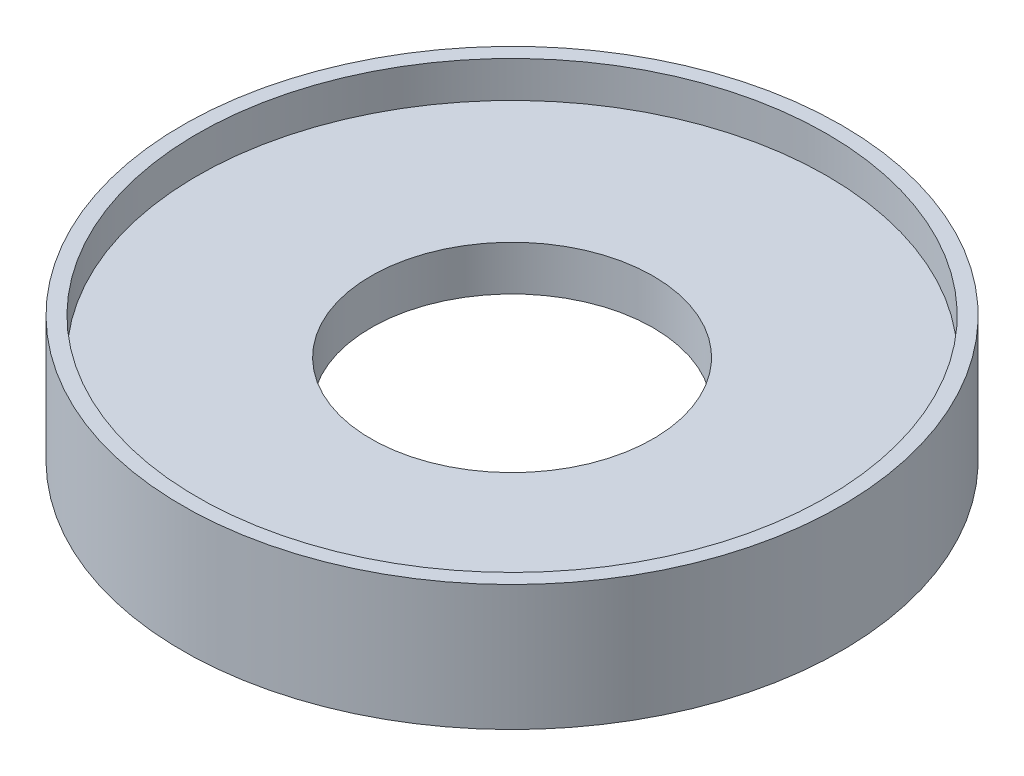
ISO-10303-21;
HEADER;
FILE_DESCRIPTION(('STEP AP214'),'2;1');
FILE_NAME('part.step','',(''),(''),'','','');
FILE_SCHEMA(('AUTOMOTIVE_DESIGN { 1 0 10303 214 1 1 1 1 }'));
ENDSEC;
DATA;
#1=APPLICATION_CONTEXT('core data for automotive mechanical design processes');
#2=APPLICATION_PROTOCOL_DEFINITION('international standard','automotive_design',2000,#1);
#3=PRODUCT_CONTEXT('',#1,'mechanical');
#4=PRODUCT('Part','Part','',(#3));
#5=PRODUCT_RELATED_PRODUCT_CATEGORY('part','',(#4));
#6=PRODUCT_DEFINITION_FORMATION('','',#4);
#7=PRODUCT_DEFINITION_CONTEXT('part definition',#1,'design');
#8=PRODUCT_DEFINITION('design','',#6,#7);
#9=PRODUCT_DEFINITION_SHAPE('','',#8);
#10=(LENGTH_UNIT() NAMED_UNIT(*) SI_UNIT(.MILLI.,.METRE.));
#11=(NAMED_UNIT(*) PLANE_ANGLE_UNIT() SI_UNIT($,.RADIAN.));
#12=(NAMED_UNIT(*) SI_UNIT($,.STERADIAN.) SOLID_ANGLE_UNIT());
#13=UNCERTAINTY_MEASURE_WITH_UNIT(LENGTH_MEASURE(1.E-05),#10,'distance_accuracy_value','');
#14=(GEOMETRIC_REPRESENTATION_CONTEXT(3) GLOBAL_UNCERTAINTY_ASSIGNED_CONTEXT((#13)) GLOBAL_UNIT_ASSIGNED_CONTEXT((#10,
#11,#12)) REPRESENTATION_CONTEXT('',''));
#15=CARTESIAN_POINT('',(0.,0.,0.));
#16=DIRECTION('',(0.,0.,1.));
#17=DIRECTION('',(1.,0.,0.));
#18=AXIS2_PLACEMENT_3D('',#15,#16,#17);
#19=CARTESIAN_POINT('',(0.,0.,0.));
#20=DIRECTION('',(0.,-1.,0.));
#21=DIRECTION('',(0.,0.,-1.));
#22=AXIS2_PLACEMENT_3D('',#19,#20,#21);
#23=CYLINDRICAL_SURFACE('',#22,19.05);
#24=CARTESIAN_POINT('',(0.,0.,0.));
#25=DIRECTION('',(0.,-1.,0.));
#26=DIRECTION('',(0.,0.,-1.));
#27=AXIS2_PLACEMENT_3D('',#24,#25,#26);
#28=CIRCLE('',#27,19.05);
#29=CARTESIAN_POINT('',(0.,0.,-19.05));
#30=VERTEX_POINT('',#29);
#31=EDGE_CURVE('E10',#30,#30,#28,.T.);
#32=ORIENTED_EDGE('',*,*,#31,.T.);
#33=EDGE_LOOP('',(#32));
#34=FACE_BOUND('',#33,.T.);
#35=CARTESIAN_POINT('',(0.,6.05,0.));
#36=DIRECTION('',(0.,-1.,0.));
#37=DIRECTION('',(0.,0.,-1.));
#38=AXIS2_PLACEMENT_3D('',#35,#36,#37);
#39=CIRCLE('',#38,19.05);
#40=CARTESIAN_POINT('',(0.,6.05,-19.05));
#41=VERTEX_POINT('',#40);
#42=EDGE_CURVE('E56',#41,#41,#39,.T.);
#43=ORIENTED_EDGE('',*,*,#42,.F.);
#44=EDGE_LOOP('',(#43));
#45=FACE_BOUND('',#44,.T.);
#46=ADVANCED_FACE('F28',(#34,#45),#23,.F.);
#47=CARTESIAN_POINT('',(0.,0.,-19.05));
#48=DIRECTION('',(0.,-1.,0.));
#49=DIRECTION('',(0.,0.,-1.));
#50=AXIS2_PLACEMENT_3D('',#47,#48,#49);
#51=PLANE('',#50);
#52=CARTESIAN_POINT('',(0.,0.,0.));
#53=DIRECTION('',(0.,-1.,0.));
#54=DIRECTION('',(0.,0.,-1.));
#55=AXIS2_PLACEMENT_3D('',#52,#53,#54);
#56=CIRCLE('',#55,42.5);
#57=CARTESIAN_POINT('',(0.,0.,-42.5));
#58=VERTEX_POINT('',#57);
#59=EDGE_CURVE('E34',#58,#58,#56,.T.);
#60=ORIENTED_EDGE('',*,*,#59,.T.);
#61=EDGE_LOOP('',(#60));
#62=FACE_BOUND('',#61,.T.);
#63=ORIENTED_EDGE('',*,*,#31,.F.);
#64=EDGE_LOOP('',(#63));
#65=FACE_BOUND('',#64,.T.);
#66=ADVANCED_FACE('F64',(#62,#65),#51,.T.);
#67=CARTESIAN_POINT('',(0.,0.,0.));
#68=DIRECTION('',(0.,-1.,0.));
#69=DIRECTION('',(0.,0.,-1.));
#70=AXIS2_PLACEMENT_3D('',#67,#68,#69);
#71=CYLINDRICAL_SURFACE('',#70,42.5);
#72=CARTESIAN_POINT('',(0.,-6.,0.));
#73=DIRECTION('',(0.,-1.,0.));
#74=DIRECTION('',(0.,0.,-1.));
#75=AXIS2_PLACEMENT_3D('',#72,#73,#74);
#76=CIRCLE('',#75,42.5);
#77=CARTESIAN_POINT('',(0.,-6.,-42.5));
#78=VERTEX_POINT('',#77);
#79=EDGE_CURVE('E38',#78,#78,#76,.T.);
#80=ORIENTED_EDGE('',*,*,#79,.T.);
#81=EDGE_LOOP('',(#80));
#82=FACE_BOUND('',#81,.T.);
#83=ORIENTED_EDGE('',*,*,#59,.F.);
#84=EDGE_LOOP('',(#83));
#85=FACE_BOUND('',#84,.T.);
#86=ADVANCED_FACE('F68',(#82,#85),#71,.F.);
#87=CARTESIAN_POINT('',(0.,-6.,-42.5));
#88=DIRECTION('',(0.,-1.,0.));
#89=DIRECTION('',(0.,0.,-1.));
#90=AXIS2_PLACEMENT_3D('',#87,#88,#89);
#91=PLANE('',#90);
#92=CARTESIAN_POINT('',(0.,-6.,0.));
#93=DIRECTION('',(0.,-1.,0.));
#94=DIRECTION('',(0.,0.,-1.));
#95=AXIS2_PLACEMENT_3D('',#92,#93,#94);
#96=CIRCLE('',#95,44.5);
#97=CARTESIAN_POINT('',(0.,-6.,-44.5));
#98=VERTEX_POINT('',#97);
#99=EDGE_CURVE('E42',#98,#98,#96,.T.);
#100=ORIENTED_EDGE('',*,*,#99,.T.);
#101=EDGE_LOOP('',(#100));
#102=FACE_BOUND('',#101,.T.);
#103=ORIENTED_EDGE('',*,*,#79,.F.);
#104=EDGE_LOOP('',(#103));
#105=FACE_BOUND('',#104,.T.);
#106=ADVANCED_FACE('F72',(#102,#105),#91,.T.);
#107=CARTESIAN_POINT('',(0.,0.,0.));
#108=DIRECTION('',(0.,-1.,0.));
#109=DIRECTION('',(0.,0.,-1.));
#110=AXIS2_PLACEMENT_3D('',#107,#108,#109);
#111=CYLINDRICAL_SURFACE('',#110,44.5);
#112=CARTESIAN_POINT('',(0.,10.96,0.));
#113=DIRECTION('',(0.,-1.,0.));
#114=DIRECTION('',(0.,0.,-1.));
#115=AXIS2_PLACEMENT_3D('',#112,#113,#114);
#116=CIRCLE('',#115,44.5);
#117=CARTESIAN_POINT('',(0.,10.96,-44.5));
#118=VERTEX_POINT('',#117);
#119=EDGE_CURVE('E47',#118,#118,#116,.T.);
#120=ORIENTED_EDGE('',*,*,#119,.T.);
#121=EDGE_LOOP('',(#120));
#122=FACE_BOUND('',#121,.T.);
#123=ORIENTED_EDGE('',*,*,#99,.F.);
#124=EDGE_LOOP('',(#123));
#125=FACE_BOUND('',#124,.T.);
#126=ADVANCED_FACE('F79',(#122,#125),#111,.T.);
#127=CARTESIAN_POINT('',(0.,10.96,-44.5));
#128=DIRECTION('',(0.,1.,0.));
#129=DIRECTION('',(0.,0.,1.));
#130=AXIS2_PLACEMENT_3D('',#127,#128,#129);
#131=PLANE('',#130);
#132=CARTESIAN_POINT('',(0.,10.96,0.));
#133=DIRECTION('',(0.,-1.,0.));
#134=DIRECTION('',(0.,0.,-1.));
#135=AXIS2_PLACEMENT_3D('',#132,#133,#134);
#136=CIRCLE('',#135,42.5);
#137=CARTESIAN_POINT('',(0.,10.96,-42.5));
#138=VERTEX_POINT('',#137);
#139=EDGE_CURVE('E50',#138,#138,#136,.T.);
#140=ORIENTED_EDGE('',*,*,#139,.T.);
#141=EDGE_LOOP('',(#140));
#142=FACE_BOUND('',#141,.T.);
#143=ORIENTED_EDGE('',*,*,#119,.F.);
#144=EDGE_LOOP('',(#143));
#145=FACE_BOUND('',#144,.T.);
#146=ADVANCED_FACE('F83',(#142,#145),#131,.T.);
#147=CARTESIAN_POINT('',(0.,0.,0.));
#148=DIRECTION('',(0.,-1.,0.));
#149=DIRECTION('',(0.,0.,-1.));
#150=AXIS2_PLACEMENT_3D('',#147,#148,#149);
#151=CYLINDRICAL_SURFACE('',#150,42.5);
#152=CARTESIAN_POINT('',(0.,6.05,0.));
#153=DIRECTION('',(0.,-1.,0.));
#154=DIRECTION('',(0.,0.,-1.));
#155=AXIS2_PLACEMENT_3D('',#152,#153,#154);
#156=CIRCLE('',#155,42.5);
#157=CARTESIAN_POINT('',(0.,6.05,-42.5));
#158=VERTEX_POINT('',#157);
#159=EDGE_CURVE('E53',#158,#158,#156,.T.);
#160=ORIENTED_EDGE('',*,*,#159,.T.);
#161=EDGE_LOOP('',(#160));
#162=FACE_BOUND('',#161,.T.);
#163=ORIENTED_EDGE('',*,*,#139,.F.);
#164=EDGE_LOOP('',(#163));
#165=FACE_BOUND('',#164,.T.);
#166=ADVANCED_FACE('F87',(#162,#165),#151,.F.);
#167=CARTESIAN_POINT('',(0.,6.05,-42.5));
#168=DIRECTION('',(0.,1.,0.));
#169=DIRECTION('',(0.,0.,1.));
#170=AXIS2_PLACEMENT_3D('',#167,#168,#169);
#171=PLANE('',#170);
#172=ORIENTED_EDGE('',*,*,#42,.T.);
#173=EDGE_LOOP('',(#172));
#174=FACE_BOUND('',#173,.T.);
#175=ORIENTED_EDGE('',*,*,#159,.F.);
#176=EDGE_LOOP('',(#175));
#177=FACE_BOUND('',#176,.T.);
#178=ADVANCED_FACE('F60',(#174,#177),#171,.T.);
#179=CLOSED_SHELL('',(#46,#66,#86,#106,#126,#146,#166,#178));
#180=MANIFOLD_SOLID_BREP('B2',#179);
#181=ADVANCED_BREP_SHAPE_REPRESENTATION('',(#18,#180),#14);
#182=SHAPE_DEFINITION_REPRESENTATION(#9,#181);
ENDSEC;
END-ISO-10303-21;
